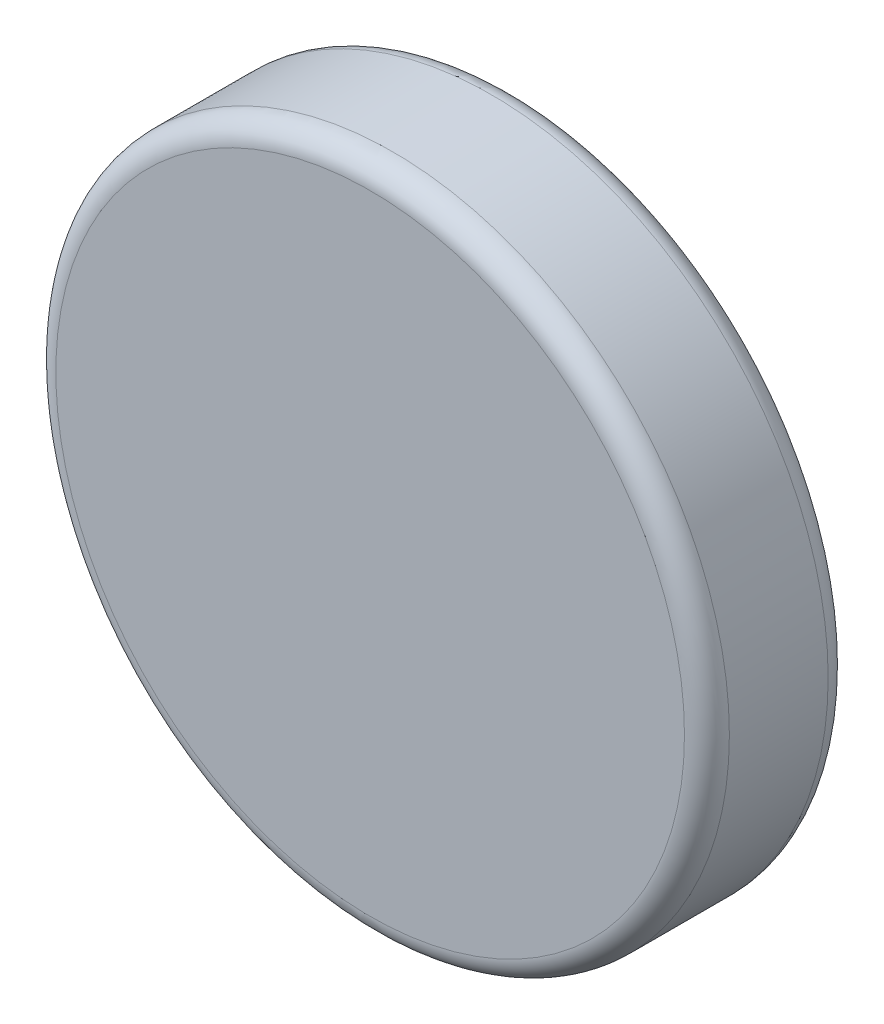
ISO-10303-21;
HEADER;
FILE_DESCRIPTION(('STEP AP214'),'2;1');
FILE_NAME('part.step','',(''),(''),'','','');
FILE_SCHEMA(('AUTOMOTIVE_DESIGN { 1 0 10303 214 1 1 1 1 }'));
ENDSEC;
DATA;
#1=APPLICATION_CONTEXT('core data for automotive mechanical design processes');
#2=APPLICATION_PROTOCOL_DEFINITION('international standard','automotive_design',2000,#1);
#3=PRODUCT_CONTEXT('',#1,'mechanical');
#4=PRODUCT('Part','Part','',(#3));
#5=PRODUCT_RELATED_PRODUCT_CATEGORY('part','',(#4));
#6=PRODUCT_DEFINITION_FORMATION('','',#4);
#7=PRODUCT_DEFINITION_CONTEXT('part definition',#1,'design');
#8=PRODUCT_DEFINITION('design','',#6,#7);
#9=PRODUCT_DEFINITION_SHAPE('','',#8);
#10=(LENGTH_UNIT() NAMED_UNIT(*) SI_UNIT(.MILLI.,.METRE.));
#11=(NAMED_UNIT(*) PLANE_ANGLE_UNIT() SI_UNIT($,.RADIAN.));
#12=(NAMED_UNIT(*) SI_UNIT($,.STERADIAN.) SOLID_ANGLE_UNIT());
#13=UNCERTAINTY_MEASURE_WITH_UNIT(LENGTH_MEASURE(1.E-05),#10,'distance_accuracy_value','');
#14=(GEOMETRIC_REPRESENTATION_CONTEXT(3) GLOBAL_UNCERTAINTY_ASSIGNED_CONTEXT((#13)) GLOBAL_UNIT_ASSIGNED_CONTEXT((#10,
#11,#12)) REPRESENTATION_CONTEXT('',''));
#15=CARTESIAN_POINT('',(0.,0.,0.));
#16=DIRECTION('',(0.,0.,1.));
#17=DIRECTION('',(1.,0.,0.));
#18=AXIS2_PLACEMENT_3D('',#15,#16,#17);
#19=CARTESIAN_POINT('',(0.,0.,3.2));
#20=DIRECTION('',(0.,0.,-1.));
#21=DIRECTION('',(-1.,0.,0.));
#22=AXIS2_PLACEMENT_3D('',#19,#20,#21);
#23=CYLINDRICAL_SURFACE('',#22,7.5);
#24=CARTESIAN_POINT('',(0.,0.,0.5));
#25=DIRECTION('',(0.,0.,1.));
#26=DIRECTION('',(1.,0.,0.));
#27=AXIS2_PLACEMENT_3D('',#24,#25,#26);
#28=CIRCLE('',#27,7.5);
#29=CARTESIAN_POINT('',(7.5,0.,0.5));
#30=VERTEX_POINT('',#29);
#31=EDGE_CURVE('E48',#30,#30,#28,.T.);
#32=ORIENTED_EDGE('',*,*,#31,.T.);
#33=EDGE_LOOP('',(#32));
#34=FACE_BOUND('',#33,.T.);
#35=CARTESIAN_POINT('',(0.,0.,2.7));
#36=DIRECTION('',(0.,0.,1.));
#37=DIRECTION('',(1.,0.,0.));
#38=AXIS2_PLACEMENT_3D('',#35,#36,#37);
#39=CIRCLE('',#38,7.5);
#40=CARTESIAN_POINT('',(7.5,0.,2.7));
#41=VERTEX_POINT('',#40);
#42=EDGE_CURVE('E52',#41,#41,#39,.F.);
#43=ORIENTED_EDGE('',*,*,#42,.T.);
#44=EDGE_LOOP('',(#43));
#45=FACE_BOUND('',#44,.T.);
#46=ADVANCED_FACE('F37',(#34,#45),#23,.T.);
#47=CARTESIAN_POINT('',(0.,0.,3.2));
#48=DIRECTION('',(0.,0.,1.));
#49=DIRECTION('',(1.,0.,0.));
#50=AXIS2_PLACEMENT_3D('',#47,#48,#49);
#51=PLANE('',#50);
#52=CARTESIAN_POINT('',(0.,0.,3.2));
#53=DIRECTION('',(0.,0.,1.));
#54=DIRECTION('',(1.,0.,0.));
#55=AXIS2_PLACEMENT_3D('',#52,#53,#54);
#56=CIRCLE('',#55,7.);
#57=CARTESIAN_POINT('',(7.,0.,3.2));
#58=VERTEX_POINT('',#57);
#59=EDGE_CURVE('E10',#58,#58,#56,.T.);
#60=ORIENTED_EDGE('',*,*,#59,.T.);
#61=EDGE_LOOP('',(#60));
#62=FACE_BOUND('',#61,.T.);
#63=ADVANCED_FACE('F68',(#62),#51,.T.);
#64=CARTESIAN_POINT('',(0.,0.,0.));
#65=DIRECTION('',(0.,0.,1.));
#66=DIRECTION('',(1.,0.,0.));
#67=AXIS2_PLACEMENT_3D('',#64,#65,#66);
#68=PLANE('',#67);
#69=CARTESIAN_POINT('',(0.,0.,0.));
#70=DIRECTION('',(0.,0.,1.));
#71=DIRECTION('',(1.,0.,0.));
#72=AXIS2_PLACEMENT_3D('',#69,#70,#71);
#73=CIRCLE('',#72,7.);
#74=CARTESIAN_POINT('',(7.,0.,0.));
#75=VERTEX_POINT('',#74);
#76=EDGE_CURVE('E44',#75,#75,#73,.F.);
#77=ORIENTED_EDGE('',*,*,#76,.T.);
#78=EDGE_LOOP('',(#77));
#79=FACE_BOUND('',#78,.T.);
#80=ADVANCED_FACE('F65',(#79),#68,.F.);
#81=CARTESIAN_POINT('',(0.,0.,0.5));
#82=DIRECTION('',(0.,0.,1.));
#83=DIRECTION('',(1.,0.,0.));
#84=AXIS2_PLACEMENT_3D('',#81,#82,#83);
#85=TOROIDAL_SURFACE('',#84,7.,0.5);
#86=ORIENTED_EDGE('',*,*,#76,.F.);
#87=EDGE_LOOP('',(#86));
#88=FACE_BOUND('',#87,.T.);
#89=ORIENTED_EDGE('',*,*,#31,.F.);
#90=EDGE_LOOP('',(#89));
#91=FACE_BOUND('',#90,.T.);
#92=ADVANCED_FACE('F61',(#88,#91),#85,.T.);
#93=CARTESIAN_POINT('',(0.,0.,2.7));
#94=DIRECTION('',(0.,0.,1.));
#95=DIRECTION('',(1.,0.,0.));
#96=AXIS2_PLACEMENT_3D('',#93,#94,#95);
#97=TOROIDAL_SURFACE('',#96,7.,0.5);
#98=ORIENTED_EDGE('',*,*,#42,.F.);
#99=EDGE_LOOP('',(#98));
#100=FACE_BOUND('',#99,.T.);
#101=ORIENTED_EDGE('',*,*,#59,.F.);
#102=EDGE_LOOP('',(#101));
#103=FACE_BOUND('',#102,.T.);
#104=ADVANCED_FACE('F39',(#100,#103),#97,.T.);
#105=CLOSED_SHELL('',(#46,#63,#80,#92,#104));
#106=MANIFOLD_SOLID_BREP('B2',#105);
#107=ADVANCED_BREP_SHAPE_REPRESENTATION('',(#18,#106),#14);
#108=SHAPE_DEFINITION_REPRESENTATION(#9,#107);
ENDSEC;
END-ISO-10303-21;
